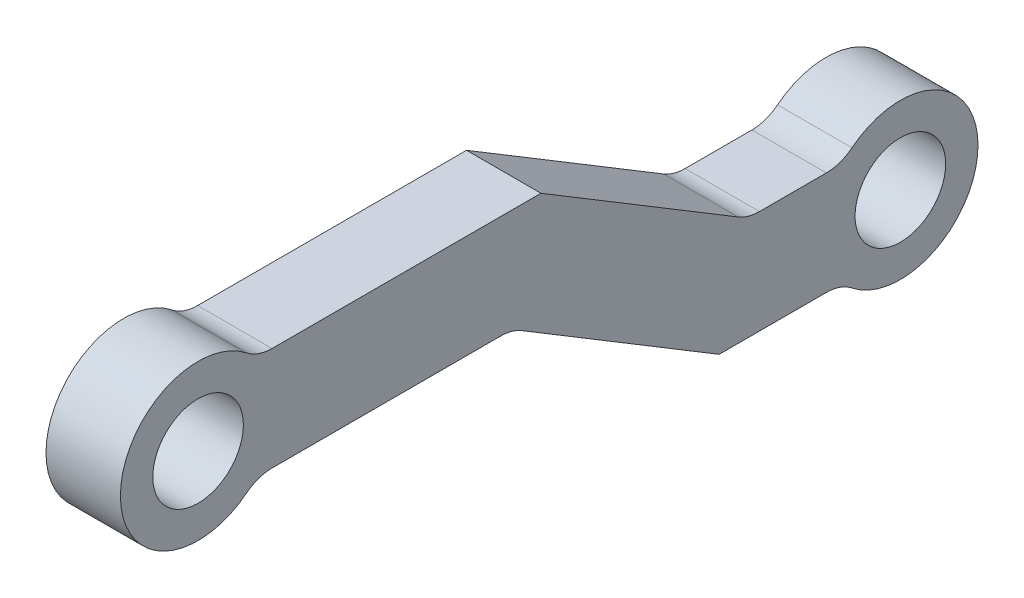
ISO-10303-21;
HEADER;
FILE_DESCRIPTION(('STEP AP214'),'2;1');
FILE_NAME('part.step','',(''),(''),'','','');
FILE_SCHEMA(('AUTOMOTIVE_DESIGN { 1 0 10303 214 1 1 1 1 }'));
ENDSEC;
DATA;
#1=APPLICATION_CONTEXT('core data for automotive mechanical design processes');
#2=APPLICATION_PROTOCOL_DEFINITION('international standard','automotive_design',2000,#1);
#3=PRODUCT_CONTEXT('',#1,'mechanical');
#4=PRODUCT('Part','Part','',(#3));
#5=PRODUCT_RELATED_PRODUCT_CATEGORY('part','',(#4));
#6=PRODUCT_DEFINITION_FORMATION('','',#4);
#7=PRODUCT_DEFINITION_CONTEXT('part definition',#1,'design');
#8=PRODUCT_DEFINITION('design','',#6,#7);
#9=PRODUCT_DEFINITION_SHAPE('','',#8);
#10=(LENGTH_UNIT() NAMED_UNIT(*) SI_UNIT(.MILLI.,.METRE.));
#11=(NAMED_UNIT(*) PLANE_ANGLE_UNIT() SI_UNIT($,.RADIAN.));
#12=(NAMED_UNIT(*) SI_UNIT($,.STERADIAN.) SOLID_ANGLE_UNIT());
#13=UNCERTAINTY_MEASURE_WITH_UNIT(LENGTH_MEASURE(1.E-05),#10,'distance_accuracy_value','');
#14=(GEOMETRIC_REPRESENTATION_CONTEXT(3) GLOBAL_UNCERTAINTY_ASSIGNED_CONTEXT((#13)) GLOBAL_UNIT_ASSIGNED_CONTEXT((#10,
#11,#12)) REPRESENTATION_CONTEXT('',''));
#15=CARTESIAN_POINT('',(0.,0.,0.));
#16=DIRECTION('',(0.,0.,1.));
#17=DIRECTION('',(1.,0.,0.));
#18=AXIS2_PLACEMENT_3D('',#15,#16,#17);
#19=CARTESIAN_POINT('',(2.875,-2.83310697109517,0.));
#20=DIRECTION('',(0.,1.,0.));
#21=DIRECTION('',(0.,0.,1.));
#22=AXIS2_PLACEMENT_3D('',#19,#20,#21);
#23=PLANE('',#22);
#24=DIRECTION('',(0.,0.,-1.));
#25=VECTOR('',#24,1.);
#26=CARTESIAN_POINT('',(0.,-2.83310697109517,0.));
#27=LINE('',#26,#25);
#28=CARTESIAN_POINT('',(0.,-2.83310697109517,-21.689696054792));
#29=VERTEX_POINT('',#28);
#30=CARTESIAN_POINT('',(0.,-2.83310697109517,-24.2737119489963));
#31=VERTEX_POINT('',#30);
#32=EDGE_CURVE('E257',#29,#31,#27,.T.);
#33=ORIENTED_EDGE('',*,*,#32,.F.);
#34=DIRECTION('',(-1.,0.,0.));
#35=VECTOR('',#34,1.);
#36=CARTESIAN_POINT('',(2.875,-2.83310697109517,-21.689696054792));
#37=LINE('',#36,#35);
#38=CARTESIAN_POINT('',(2.875,-2.83310697109517,-21.689696054792));
#39=VERTEX_POINT('',#38);
#40=EDGE_CURVE('E327',#29,#39,#37,.F.);
#41=ORIENTED_EDGE('',*,*,#40,.T.);
#42=DIRECTION('',(0.,0.,-1.));
#43=VECTOR('',#42,1.);
#44=CARTESIAN_POINT('',(2.875,-2.83310697109517,0.));
#45=LINE('',#44,#43);
#46=CARTESIAN_POINT('',(2.875,-2.83310697109517,-24.2737119489963));
#47=VERTEX_POINT('',#46);
#48=EDGE_CURVE('E241',#39,#47,#45,.T.);
#49=ORIENTED_EDGE('',*,*,#48,.T.);
#50=DIRECTION('',(-1.,0.,0.));
#51=VECTOR('',#50,1.);
#52=CARTESIAN_POINT('',(2.875,-2.83310697109517,-24.2737119489963));
#53=LINE('',#52,#51);
#54=EDGE_CURVE('E323',#47,#31,#53,.T.);
#55=ORIENTED_EDGE('',*,*,#54,.T.);
#56=EDGE_LOOP('',(#33,#41,#49,#55));
#57=FACE_BOUND('',#56,.T.);
#58=ADVANCED_FACE('F113',(#57),#23,.T.);
#59=CARTESIAN_POINT('',(2.875,7.32848216707025,-4.42741728115174));
#60=DIRECTION('',(0.,0.855926261123693,-0.517097897422544));
#61=DIRECTION('',(0.,0.517097897422544,0.855926261123693));
#62=AXIS2_PLACEMENT_3D('',#59,#60,#61);
#63=PLANE('',#62);
#64=DIRECTION('',(0.,-0.517097897422544,-0.855926261123693));
#65=VECTOR('',#64,1.);
#66=CARTESIAN_POINT('',(2.875,7.32848216707025,-4.42741728115174));
#67=LINE('',#66,#65);
#68=CARTESIAN_POINT('',(2.875,2.,-13.2473870421154));
#69=VERTEX_POINT('',#68);
#70=CARTESIAN_POINT('',(2.875,-2.60438991062904,-20.8688031426337));
#71=VERTEX_POINT('',#70);
#72=EDGE_CURVE('E221',#69,#71,#67,.T.);
#73=ORIENTED_EDGE('',*,*,#72,.T.);
#74=DIRECTION('',(-1.,0.,0.));
#75=VECTOR('',#74,1.);
#76=CARTESIAN_POINT('',(0.,-2.60438991062904,-20.8688031426337));
#77=LINE('',#76,#75);
#78=CARTESIAN_POINT('',(0.,-2.60438991062904,-20.8688031426337));
#79=VERTEX_POINT('',#78);
#80=EDGE_CURVE('E320',#71,#79,#77,.T.);
#81=ORIENTED_EDGE('',*,*,#80,.T.);
#82=DIRECTION('',(0.,-0.517097897422544,-0.855926261123693));
#83=VECTOR('',#82,1.);
#84=CARTESIAN_POINT('',(0.,7.32848216707025,-4.42741728115174));
#85=LINE('',#84,#83);
#86=CARTESIAN_POINT('',(0.,2.,-13.2473870421154));
#87=VERTEX_POINT('',#86);
#88=EDGE_CURVE('E229',#87,#79,#85,.T.);
#89=ORIENTED_EDGE('',*,*,#88,.F.);
#90=DIRECTION('',(-1.,0.,0.));
#91=VECTOR('',#90,1.);
#92=CARTESIAN_POINT('',(2.875,2.,-13.2473870421154));
#93=LINE('',#92,#91);
#94=EDGE_CURVE('E214',#69,#87,#93,.T.);
#95=ORIENTED_EDGE('',*,*,#94,.F.);
#96=EDGE_LOOP('',(#73,#81,#89,#95));
#97=FACE_BOUND('',#96,.T.);
#98=ADVANCED_FACE('F225',(#97),#63,.T.);
#99=CARTESIAN_POINT('',(2.875,2.,0.));
#100=DIRECTION('',(0.,1.,0.));
#101=DIRECTION('',(0.,0.,1.));
#102=AXIS2_PLACEMENT_3D('',#99,#100,#101);
#103=PLANE('',#102);
#104=DIRECTION('',(0.,0.,-1.));
#105=VECTOR('',#104,1.);
#106=CARTESIAN_POINT('',(0.,2.,0.));
#107=LINE('',#106,#105);
#108=CARTESIAN_POINT('',(0.,2.,-2.85919569109916));
#109=VERTEX_POINT('',#108);
#110=EDGE_CURVE('E264',#109,#87,#107,.T.);
#111=ORIENTED_EDGE('',*,*,#110,.F.);
#112=DIRECTION('',(-1.,0.,0.));
#113=VECTOR('',#112,1.);
#114=CARTESIAN_POINT('',(2.875,2.,-2.85919569109916));
#115=LINE('',#114,#113);
#116=CARTESIAN_POINT('',(2.875,2.,-2.85919569109916));
#117=VERTEX_POINT('',#116);
#118=EDGE_CURVE('E129',#109,#117,#115,.F.);
#119=ORIENTED_EDGE('',*,*,#118,.T.);
#120=DIRECTION('',(0.,0.,-1.));
#121=VECTOR('',#120,1.);
#122=CARTESIAN_POINT('',(2.875,2.,0.));
#123=LINE('',#122,#121);
#124=EDGE_CURVE('E211',#117,#69,#123,.T.);
#125=ORIENTED_EDGE('',*,*,#124,.T.);
#126=ORIENTED_EDGE('',*,*,#94,.T.);
#127=EDGE_LOOP('',(#111,#119,#125,#126));
#128=FACE_BOUND('',#127,.T.);
#129=ADVANCED_FACE('F213',(#128),#103,.T.);
#130=CARTESIAN_POINT('',(2.875,-2.,0.));
#131=DIRECTION('',(0.,1.,0.));
#132=DIRECTION('',(0.,0.,1.));
#133=AXIS2_PLACEMENT_3D('',#130,#131,#132);
#134=PLANE('',#133);
#135=DIRECTION('',(0.,0.,-1.));
#136=VECTOR('',#135,1.);
#137=CARTESIAN_POINT('',(0.,-2.,0.));
#138=LINE('',#137,#136);
#139=CARTESIAN_POINT('',(0.,-2.,-2.85919569109916));
#140=VERTEX_POINT('',#139);
#141=CARTESIAN_POINT('',(0.,-2.,-11.6905986274188));
#142=VERTEX_POINT('',#141);
#143=EDGE_CURVE('E267',#140,#142,#138,.T.);
#144=ORIENTED_EDGE('',*,*,#143,.T.);
#145=DIRECTION('',(-1.,0.,0.));
#146=VECTOR('',#145,1.);
#147=CARTESIAN_POINT('',(2.875,-2.,-11.6905986274188));
#148=LINE('',#147,#146);
#149=CARTESIAN_POINT('',(2.875,-2.,-11.6905986274188));
#150=VERTEX_POINT('',#149);
#151=EDGE_CURVE('E338',#142,#150,#148,.F.);
#152=ORIENTED_EDGE('',*,*,#151,.T.);
#153=DIRECTION('',(0.,0.,-1.));
#154=VECTOR('',#153,1.);
#155=CARTESIAN_POINT('',(2.875,-2.,0.));
#156=LINE('',#155,#154);
#157=CARTESIAN_POINT('',(2.875,-2.,-2.85919569109916));
#158=VERTEX_POINT('',#157);
#159=EDGE_CURVE('E220',#158,#150,#156,.T.);
#160=ORIENTED_EDGE('',*,*,#159,.F.);
#161=DIRECTION('',(1.,0.,0.));
#162=VECTOR('',#161,1.);
#163=CARTESIAN_POINT('',(0.,-2.,-2.85919569109916));
#164=LINE('',#163,#162);
#165=EDGE_CURVE('E334',#158,#140,#164,.F.);
#166=ORIENTED_EDGE('',*,*,#165,.T.);
#167=EDGE_LOOP('',(#144,#152,#160,#166));
#168=FACE_BOUND('',#167,.T.);
#169=ADVANCED_FACE('F412',(#168),#134,.F.);
#170=CARTESIAN_POINT('',(2.875,3.90477712257548,-2.35902569146156));
#171=DIRECTION('',(0.,0.855926261123693,-0.517097897422544));
#172=DIRECTION('',(0.,0.517097897422544,0.855926261123693));
#173=AXIS2_PLACEMENT_3D('',#170,#171,#172);
#174=PLANE('',#173);
#175=DIRECTION('',(0.,-0.517097897422544,-0.855926261123693));
#176=VECTOR('',#175,1.);
#177=CARTESIAN_POINT('',(2.875,3.90477712257548,-2.35902569146156));
#178=LINE('',#177,#176);
#179=CARTESIAN_POINT('',(2.875,-2.22871706046614,-12.5114915395771));
#180=VERTEX_POINT('',#179);
#181=CARTESIAN_POINT('',(2.875,-6.83310697109518,-20.1329076400955));
#182=VERTEX_POINT('',#181);
#183=EDGE_CURVE('E251',#180,#182,#178,.T.);
#184=ORIENTED_EDGE('',*,*,#183,.F.);
#185=DIRECTION('',(-1.,0.,0.));
#186=VECTOR('',#185,1.);
#187=CARTESIAN_POINT('',(0.,-2.22871706046614,-12.5114915395771));
#188=LINE('',#187,#186);
#189=CARTESIAN_POINT('',(0.,-2.22871706046614,-12.5114915395771));
#190=VERTEX_POINT('',#189);
#191=EDGE_CURVE('E330',#180,#190,#188,.T.);
#192=ORIENTED_EDGE('',*,*,#191,.T.);
#193=DIRECTION('',(0.,-0.517097897422544,-0.855926261123693));
#194=VECTOR('',#193,1.);
#195=CARTESIAN_POINT('',(0.,3.90477712257548,-2.35902569146156));
#196=LINE('',#195,#194);
#197=CARTESIAN_POINT('',(0.,-6.83310697109518,-20.1329076400955));
#198=VERTEX_POINT('',#197);
#199=EDGE_CURVE('E271',#190,#198,#196,.T.);
#200=ORIENTED_EDGE('',*,*,#199,.T.);
#201=DIRECTION('',(-1.,0.,0.));
#202=VECTOR('',#201,1.);
#203=CARTESIAN_POINT('',(2.875,-6.83310697109518,-20.1329076400955));
#204=LINE('',#203,#202);
#205=EDGE_CURVE('E232',#182,#198,#204,.T.);
#206=ORIENTED_EDGE('',*,*,#205,.F.);
#207=EDGE_LOOP('',(#184,#192,#200,#206));
#208=FACE_BOUND('',#207,.T.);
#209=ADVANCED_FACE('F406',(#208),#174,.F.);
#210=CARTESIAN_POINT('',(2.875,-6.83310697109517,0.));
#211=DIRECTION('',(0.,1.,0.));
#212=DIRECTION('',(0.,0.,1.));
#213=AXIS2_PLACEMENT_3D('',#210,#211,#212);
#214=PLANE('',#213);
#215=DIRECTION('',(0.,0.,-1.));
#216=VECTOR('',#215,1.);
#217=CARTESIAN_POINT('',(0.,-6.83310697109517,0.));
#218=LINE('',#217,#216);
#219=CARTESIAN_POINT('',(0.,-6.83310697109517,-24.2737119489963));
#220=VERTEX_POINT('',#219);
#221=EDGE_CURVE('E245',#198,#220,#218,.T.);
#222=ORIENTED_EDGE('',*,*,#221,.T.);
#223=DIRECTION('',(1.,0.,0.));
#224=VECTOR('',#223,1.);
#225=CARTESIAN_POINT('',(2.875,-6.83310697109517,-24.2737119489963));
#226=LINE('',#225,#224);
#227=CARTESIAN_POINT('',(2.875,-6.83310697109517,-24.2737119489963));
#228=VERTEX_POINT('',#227);
#229=EDGE_CURVE('E317',#220,#228,#226,.T.);
#230=ORIENTED_EDGE('',*,*,#229,.T.);
#231=DIRECTION('',(0.,0.,-1.));
#232=VECTOR('',#231,1.);
#233=CARTESIAN_POINT('',(2.875,-6.83310697109517,0.));
#234=LINE('',#233,#232);
#235=EDGE_CURVE('E254',#182,#228,#234,.T.);
#236=ORIENTED_EDGE('',*,*,#235,.F.);
#237=ORIENTED_EDGE('',*,*,#205,.T.);
#238=EDGE_LOOP('',(#222,#230,#236,#237));
#239=FACE_BOUND('',#238,.T.);
#240=ADVANCED_FACE('F401',(#239),#214,.F.);
#241=CARTESIAN_POINT('',(0.,0.,0.));
#242=DIRECTION('',(1.,0.,0.));
#243=DIRECTION('',(0.,0.,-1.));
#244=AXIS2_PLACEMENT_3D('',#241,#242,#243);
#245=PLANE('',#244);
#246=ORIENTED_EDGE('',*,*,#88,.T.);
#247=CARTESIAN_POINT('',(0.,-1.24560697109517,-21.689696054792));
#248=DIRECTION('',(1.,0.,0.));
#249=DIRECTION('',(0.,0.,-1.));
#250=AXIS2_PLACEMENT_3D('',#247,#248,#249);
#251=CIRCLE('',#250,1.5875);
#252=EDGE_CURVE('E356',#79,#29,#251,.T.);
#253=ORIENTED_EDGE('',*,*,#252,.T.);
#254=ORIENTED_EDGE('',*,*,#32,.T.);
#255=CARTESIAN_POINT('',(0.,-1.24560697109517,-24.2737119489963));
#256=DIRECTION('',(1.,0.,0.));
#257=DIRECTION('',(0.,0.,-1.));
#258=AXIS2_PLACEMENT_3D('',#255,#256,#257);
#259=CIRCLE('',#258,1.5875);
#260=CARTESIAN_POINT('',(0.,-2.48705792477365,-25.2631338911478));
#261=VERTEX_POINT('',#260);
#262=EDGE_CURVE('E373',#31,#261,#259,.T.);
#263=ORIENTED_EDGE('',*,*,#262,.T.);
#264=CARTESIAN_POINT('',(0.,-4.83310697109517,-27.1329076400955));
#265=DIRECTION('',(1.,0.,0.));
#266=DIRECTION('',(0.,0.,-1.));
#267=AXIS2_PLACEMENT_3D('',#264,#265,#266);
#268=CIRCLE('',#267,2.99999999999999);
#269=CARTESIAN_POINT('',(0.,-7.1791560174167,-25.2631338911478));
#270=VERTEX_POINT('',#269);
#271=EDGE_CURVE('E300',#270,#261,#268,.T.);
#272=ORIENTED_EDGE('',*,*,#271,.F.);
#273=CARTESIAN_POINT('',(0.,-8.42060697109518,-24.2737119489963));
#274=DIRECTION('',(1.,0.,0.));
#275=DIRECTION('',(0.,0.,-1.));
#276=AXIS2_PLACEMENT_3D('',#273,#274,#275);
#277=CIRCLE('',#276,1.5875);
#278=EDGE_CURVE('E350',#270,#220,#277,.T.);
#279=ORIENTED_EDGE('',*,*,#278,.T.);
#280=ORIENTED_EDGE('',*,*,#221,.F.);
#281=ORIENTED_EDGE('',*,*,#199,.F.);
#282=CARTESIAN_POINT('',(0.,-3.5875,-11.6905986274188));
#283=DIRECTION('',(1.,0.,0.));
#284=DIRECTION('',(0.,0.,-1.));
#285=AXIS2_PLACEMENT_3D('',#282,#283,#284);
#286=CIRCLE('',#285,1.5875);
#287=EDGE_CURVE('E361',#190,#142,#286,.T.);
#288=ORIENTED_EDGE('',*,*,#287,.T.);
#289=ORIENTED_EDGE('',*,*,#143,.F.);
#290=CARTESIAN_POINT('',(0.,-3.5875,-2.85919569109916));
#291=DIRECTION('',(1.,0.,0.));
#292=DIRECTION('',(0.,0.,-1.));
#293=AXIS2_PLACEMENT_3D('',#290,#291,#292);
#294=CIRCLE('',#293,1.5875);
#295=CARTESIAN_POINT('',(0.,-2.34604904632153,-1.86977374894768));
#296=VERTEX_POINT('',#295);
#297=EDGE_CURVE('E367',#140,#296,#294,.T.);
#298=ORIENTED_EDGE('',*,*,#297,.T.);
#299=CARTESIAN_POINT('',(0.,0.,0.));
#300=DIRECTION('',(1.,0.,0.));
#301=DIRECTION('',(0.,0.,-1.));
#302=AXIS2_PLACEMENT_3D('',#299,#300,#301);
#303=CIRCLE('',#302,3.);
#304=CARTESIAN_POINT('',(0.,2.34604904632153,-1.86977374894768));
#305=VERTEX_POINT('',#304);
#306=EDGE_CURVE('E284',#305,#296,#303,.T.);
#307=ORIENTED_EDGE('',*,*,#306,.F.);
#308=CARTESIAN_POINT('',(0.,3.5875,-2.85919569109916));
#309=DIRECTION('',(1.,0.,0.));
#310=DIRECTION('',(0.,0.,-1.));
#311=AXIS2_PLACEMENT_3D('',#308,#309,#310);
#312=CIRCLE('',#311,1.5875);
#313=EDGE_CURVE('E122',#305,#109,#312,.T.);
#314=ORIENTED_EDGE('',*,*,#313,.T.);
#315=ORIENTED_EDGE('',*,*,#110,.T.);
#316=EDGE_LOOP('',(#246,#253,#254,#263,#272,#279,#280,#281,#288,#289,#298,#307,#314,#315));
#317=FACE_BOUND('',#316,.T.);
#318=CARTESIAN_POINT('',(0.,0.,0.));
#319=DIRECTION('',(1.,0.,0.));
#320=DIRECTION('',(0.,0.,-1.));
#321=AXIS2_PLACEMENT_3D('',#318,#319,#320);
#322=CIRCLE('',#321,1.75);
#323=CARTESIAN_POINT('',(0.,0.,-1.75));
#324=VERTEX_POINT('',#323);
#325=EDGE_CURVE('E285',#324,#324,#322,.T.);
#326=ORIENTED_EDGE('',*,*,#325,.T.);
#327=EDGE_LOOP('',(#326));
#328=FACE_BOUND('',#327,.T.);
#329=CARTESIAN_POINT('',(0.,-4.83310697109517,-27.1329076400955));
#330=DIRECTION('',(1.,0.,0.));
#331=DIRECTION('',(0.,0.,-1.));
#332=AXIS2_PLACEMENT_3D('',#329,#330,#331);
#333=CIRCLE('',#332,1.75);
#334=CARTESIAN_POINT('',(0.,-4.83310697109517,-28.8829076400955));
#335=VERTEX_POINT('',#334);
#336=EDGE_CURVE('E301',#335,#335,#333,.T.);
#337=ORIENTED_EDGE('',*,*,#336,.T.);
#338=EDGE_LOOP('',(#337));
#339=FACE_BOUND('',#338,.T.);
#340=ADVANCED_FACE('F389',(#317,#328,#339),#245,.F.);
#341=CARTESIAN_POINT('',(2.875,0.,0.));
#342=DIRECTION('',(1.,0.,0.));
#343=DIRECTION('',(0.,0.,-1.));
#344=AXIS2_PLACEMENT_3D('',#341,#342,#343);
#345=PLANE('',#344);
#346=ORIENTED_EDGE('',*,*,#235,.T.);
#347=CARTESIAN_POINT('',(2.875,-8.42060697109518,-24.2737119489963));
#348=DIRECTION('',(1.,0.,0.));
#349=DIRECTION('',(0.,0.,-1.));
#350=AXIS2_PLACEMENT_3D('',#347,#348,#349);
#351=CIRCLE('',#350,1.5875);
#352=CARTESIAN_POINT('',(2.875,-7.1791560174167,-25.2631338911478));
#353=VERTEX_POINT('',#352);
#354=EDGE_CURVE('E353',#228,#353,#351,.F.);
#355=ORIENTED_EDGE('',*,*,#354,.T.);
#356=CARTESIAN_POINT('',(2.875,-4.83310697109517,-27.1329076400955));
#357=DIRECTION('',(1.,0.,0.));
#358=DIRECTION('',(0.,0.,-1.));
#359=AXIS2_PLACEMENT_3D('',#356,#357,#358);
#360=CIRCLE('',#359,2.99999999999999);
#361=CARTESIAN_POINT('',(2.875,-2.48705792477365,-25.2631338911478));
#362=VERTEX_POINT('',#361);
#363=EDGE_CURVE('E289',#353,#362,#360,.T.);
#364=ORIENTED_EDGE('',*,*,#363,.T.);
#365=CARTESIAN_POINT('',(2.875,-1.24560697109517,-24.2737119489963));
#366=DIRECTION('',(1.,0.,0.));
#367=DIRECTION('',(0.,0.,-1.));
#368=AXIS2_PLACEMENT_3D('',#365,#366,#367);
#369=CIRCLE('',#368,1.5875);
#370=EDGE_CURVE('E376',#362,#47,#369,.F.);
#371=ORIENTED_EDGE('',*,*,#370,.T.);
#372=ORIENTED_EDGE('',*,*,#48,.F.);
#373=CARTESIAN_POINT('',(2.875,-1.24560697109517,-21.689696054792));
#374=DIRECTION('',(1.,0.,0.));
#375=DIRECTION('',(0.,0.,-1.));
#376=AXIS2_PLACEMENT_3D('',#373,#374,#375);
#377=CIRCLE('',#376,1.5875);
#378=EDGE_CURVE('E239',#39,#71,#377,.F.);
#379=ORIENTED_EDGE('',*,*,#378,.T.);
#380=ORIENTED_EDGE('',*,*,#72,.F.);
#381=ORIENTED_EDGE('',*,*,#124,.F.);
#382=CARTESIAN_POINT('',(2.875,3.5875,-2.85919569109916));
#383=DIRECTION('',(1.,0.,0.));
#384=DIRECTION('',(0.,0.,-1.));
#385=AXIS2_PLACEMENT_3D('',#382,#383,#384);
#386=CIRCLE('',#385,1.5875);
#387=CARTESIAN_POINT('',(2.875,2.34604904632153,-1.86977374894768));
#388=VERTEX_POINT('',#387);
#389=EDGE_CURVE('E12',#117,#388,#386,.F.);
#390=ORIENTED_EDGE('',*,*,#389,.T.);
#391=CARTESIAN_POINT('',(2.875,0.,0.));
#392=DIRECTION('',(1.,0.,0.));
#393=DIRECTION('',(0.,0.,-1.));
#394=AXIS2_PLACEMENT_3D('',#391,#392,#393);
#395=CIRCLE('',#394,3.);
#396=CARTESIAN_POINT('',(2.875,-2.34604904632153,-1.86977374894768));
#397=VERTEX_POINT('',#396);
#398=EDGE_CURVE('E261',#388,#397,#395,.T.);
#399=ORIENTED_EDGE('',*,*,#398,.T.);
#400=CARTESIAN_POINT('',(2.875,-3.5875,-2.85919569109916));
#401=DIRECTION('',(1.,0.,0.));
#402=DIRECTION('',(0.,0.,-1.));
#403=AXIS2_PLACEMENT_3D('',#400,#401,#402);
#404=CIRCLE('',#403,1.5875);
#405=EDGE_CURVE('E370',#397,#158,#404,.F.);
#406=ORIENTED_EDGE('',*,*,#405,.T.);
#407=ORIENTED_EDGE('',*,*,#159,.T.);
#408=CARTESIAN_POINT('',(2.875,-3.5875,-11.6905986274188));
#409=DIRECTION('',(1.,0.,0.));
#410=DIRECTION('',(0.,0.,-1.));
#411=AXIS2_PLACEMENT_3D('',#408,#409,#410);
#412=CIRCLE('',#411,1.5875);
#413=EDGE_CURVE('E364',#150,#180,#412,.F.);
#414=ORIENTED_EDGE('',*,*,#413,.T.);
#415=ORIENTED_EDGE('',*,*,#183,.T.);
#416=EDGE_LOOP('',(#346,#355,#364,#371,#372,#379,#380,#381,#390,#399,#406,#407,#414,#415));
#417=FACE_BOUND('',#416,.T.);
#418=CARTESIAN_POINT('',(2.875,0.,0.));
#419=DIRECTION('',(1.,0.,0.));
#420=DIRECTION('',(0.,0.,-1.));
#421=AXIS2_PLACEMENT_3D('',#418,#419,#420);
#422=CIRCLE('',#421,1.75);
#423=CARTESIAN_POINT('',(2.875,0.,-1.75));
#424=VERTEX_POINT('',#423);
#425=EDGE_CURVE('E280',#424,#424,#422,.T.);
#426=ORIENTED_EDGE('',*,*,#425,.F.);
#427=EDGE_LOOP('',(#426));
#428=FACE_BOUND('',#427,.T.);
#429=CARTESIAN_POINT('',(2.875,-4.83310697109517,-27.1329076400955));
#430=DIRECTION('',(1.,0.,0.));
#431=DIRECTION('',(0.,0.,-1.));
#432=AXIS2_PLACEMENT_3D('',#429,#430,#431);
#433=CIRCLE('',#432,1.75);
#434=CARTESIAN_POINT('',(2.875,-4.83310697109517,-28.8829076400955));
#435=VERTEX_POINT('',#434);
#436=EDGE_CURVE('E296',#435,#435,#433,.T.);
#437=ORIENTED_EDGE('',*,*,#436,.F.);
#438=EDGE_LOOP('',(#437));
#439=FACE_BOUND('',#438,.T.);
#440=ADVANCED_FACE('F235',(#417,#428,#439),#345,.T.);
#441=CARTESIAN_POINT('',(2.875,-4.83310697109517,-27.1329076400955));
#442=DIRECTION('',(-1.,0.,0.));
#443=DIRECTION('',(0.,0.,1.));
#444=AXIS2_PLACEMENT_3D('',#441,#442,#443);
#445=CYLINDRICAL_SURFACE('',#444,1.75);
#446=ORIENTED_EDGE('',*,*,#436,.T.);
#447=EDGE_LOOP('',(#446));
#448=FACE_BOUND('',#447,.T.);
#449=ORIENTED_EDGE('',*,*,#336,.F.);
#450=EDGE_LOOP('',(#449));
#451=FACE_BOUND('',#450,.T.);
#452=ADVANCED_FACE('F444',(#448,#451),#445,.F.);
#453=CARTESIAN_POINT('',(2.875,-4.83310697109517,-27.1329076400955));
#454=DIRECTION('',(-1.,0.,0.));
#455=DIRECTION('',(0.,0.,1.));
#456=AXIS2_PLACEMENT_3D('',#453,#454,#455);
#457=CYLINDRICAL_SURFACE('',#456,2.99999999999999);
#458=ORIENTED_EDGE('',*,*,#363,.F.);
#459=DIRECTION('',(-1.,0.,0.));
#460=VECTOR('',#459,1.);
#461=CARTESIAN_POINT('',(2.875,-7.1791560174167,-25.2631338911478));
#462=LINE('',#461,#460);
#463=EDGE_CURVE('E313',#353,#270,#462,.T.);
#464=ORIENTED_EDGE('',*,*,#463,.T.);
#465=ORIENTED_EDGE('',*,*,#271,.T.);
#466=DIRECTION('',(-1.,0.,0.));
#467=VECTOR('',#466,1.);
#468=CARTESIAN_POINT('',(2.875,-2.48705792477365,-25.2631338911478));
#469=LINE('',#468,#467);
#470=EDGE_CURVE('E231',#261,#362,#469,.F.);
#471=ORIENTED_EDGE('',*,*,#470,.T.);
#472=EDGE_LOOP('',(#458,#464,#465,#471));
#473=FACE_BOUND('',#472,.T.);
#474=ADVANCED_FACE('F392',(#473),#457,.T.);
#475=CARTESIAN_POINT('',(2.875,0.,0.));
#476=DIRECTION('',(-1.,0.,0.));
#477=DIRECTION('',(0.,0.,1.));
#478=AXIS2_PLACEMENT_3D('',#475,#476,#477);
#479=CYLINDRICAL_SURFACE('',#478,1.75);
#480=ORIENTED_EDGE('',*,*,#425,.T.);
#481=EDGE_LOOP('',(#480));
#482=FACE_BOUND('',#481,.T.);
#483=ORIENTED_EDGE('',*,*,#325,.F.);
#484=EDGE_LOOP('',(#483));
#485=FACE_BOUND('',#484,.T.);
#486=ADVANCED_FACE('F439',(#482,#485),#479,.F.);
#487=CARTESIAN_POINT('',(2.875,0.,0.));
#488=DIRECTION('',(-1.,0.,0.));
#489=DIRECTION('',(0.,0.,1.));
#490=AXIS2_PLACEMENT_3D('',#487,#488,#489);
#491=CYLINDRICAL_SURFACE('',#490,3.);
#492=ORIENTED_EDGE('',*,*,#306,.T.);
#493=DIRECTION('',(-1.,0.,0.));
#494=VECTOR('',#493,1.);
#495=CARTESIAN_POINT('',(2.875,-2.34604904632153,-1.86977374894768));
#496=LINE('',#495,#494);
#497=EDGE_CURVE('E345',#296,#397,#496,.F.);
#498=ORIENTED_EDGE('',*,*,#497,.T.);
#499=ORIENTED_EDGE('',*,*,#398,.F.);
#500=DIRECTION('',(-1.,0.,0.));
#501=VECTOR('',#500,1.);
#502=CARTESIAN_POINT('',(2.875,2.34604904632153,-1.86977374894768));
#503=LINE('',#502,#501);
#504=EDGE_CURVE('E341',#388,#305,#503,.T.);
#505=ORIENTED_EDGE('',*,*,#504,.T.);
#506=EDGE_LOOP('',(#492,#498,#499,#505));
#507=FACE_BOUND('',#506,.T.);
#508=ADVANCED_FACE('F422',(#507),#491,.T.);
#509=CARTESIAN_POINT('',(2.875,-8.42060697109518,-24.2737119489963));
#510=DIRECTION('',(-1.,0.,0.));
#511=DIRECTION('',(0.,0.,1.));
#512=AXIS2_PLACEMENT_3D('',#509,#510,#511);
#513=CYLINDRICAL_SURFACE('',#512,1.5875);
#514=ORIENTED_EDGE('',*,*,#354,.F.);
#515=ORIENTED_EDGE('',*,*,#229,.F.);
#516=ORIENTED_EDGE('',*,*,#278,.F.);
#517=ORIENTED_EDGE('',*,*,#463,.F.);
#518=EDGE_LOOP('',(#514,#515,#516,#517));
#519=FACE_BOUND('',#518,.T.);
#520=ADVANCED_FACE('F396',(#519),#513,.F.);
#521=CARTESIAN_POINT('',(2.875,-1.24560697109517,-21.689696054792));
#522=DIRECTION('',(1.,0.,0.));
#523=DIRECTION('',(0.,0.,-1.));
#524=AXIS2_PLACEMENT_3D('',#521,#522,#523);
#525=CYLINDRICAL_SURFACE('',#524,1.5875);
#526=ORIENTED_EDGE('',*,*,#378,.F.);
#527=ORIENTED_EDGE('',*,*,#40,.F.);
#528=ORIENTED_EDGE('',*,*,#252,.F.);
#529=ORIENTED_EDGE('',*,*,#80,.F.);
#530=EDGE_LOOP('',(#526,#527,#528,#529));
#531=FACE_BOUND('',#530,.T.);
#532=ADVANCED_FACE('F452',(#531),#525,.F.);
#533=CARTESIAN_POINT('',(2.875,-3.5875,-11.6905986274188));
#534=DIRECTION('',(1.,0.,0.));
#535=DIRECTION('',(0.,0.,-1.));
#536=AXIS2_PLACEMENT_3D('',#533,#534,#535);
#537=CYLINDRICAL_SURFACE('',#536,1.5875);
#538=ORIENTED_EDGE('',*,*,#413,.F.);
#539=ORIENTED_EDGE('',*,*,#151,.F.);
#540=ORIENTED_EDGE('',*,*,#287,.F.);
#541=ORIENTED_EDGE('',*,*,#191,.F.);
#542=EDGE_LOOP('',(#538,#539,#540,#541));
#543=FACE_BOUND('',#542,.T.);
#544=ADVANCED_FACE('F416',(#543),#537,.F.);
#545=CARTESIAN_POINT('',(2.875,-3.5875,-2.85919569109916));
#546=DIRECTION('',(-1.,0.,0.));
#547=DIRECTION('',(0.,0.,1.));
#548=AXIS2_PLACEMENT_3D('',#545,#546,#547);
#549=CYLINDRICAL_SURFACE('',#548,1.5875);
#550=ORIENTED_EDGE('',*,*,#405,.F.);
#551=ORIENTED_EDGE('',*,*,#497,.F.);
#552=ORIENTED_EDGE('',*,*,#297,.F.);
#553=ORIENTED_EDGE('',*,*,#165,.F.);
#554=EDGE_LOOP('',(#550,#551,#552,#553));
#555=FACE_BOUND('',#554,.T.);
#556=ADVANCED_FACE('F419',(#555),#549,.F.);
#557=CARTESIAN_POINT('',(2.875,-1.24560697109517,-24.2737119489963));
#558=DIRECTION('',(-1.,0.,0.));
#559=DIRECTION('',(0.,0.,1.));
#560=AXIS2_PLACEMENT_3D('',#557,#558,#559);
#561=CYLINDRICAL_SURFACE('',#560,1.5875);
#562=ORIENTED_EDGE('',*,*,#370,.F.);
#563=ORIENTED_EDGE('',*,*,#470,.F.);
#564=ORIENTED_EDGE('',*,*,#262,.F.);
#565=ORIENTED_EDGE('',*,*,#54,.F.);
#566=EDGE_LOOP('',(#562,#563,#564,#565));
#567=FACE_BOUND('',#566,.T.);
#568=ADVANCED_FACE('F387',(#567),#561,.F.);
#569=CARTESIAN_POINT('',(2.875,3.5875,-2.85919569109916));
#570=DIRECTION('',(-1.,0.,0.));
#571=DIRECTION('',(0.,0.,1.));
#572=AXIS2_PLACEMENT_3D('',#569,#570,#571);
#573=CYLINDRICAL_SURFACE('',#572,1.5875);
#574=ORIENTED_EDGE('',*,*,#389,.F.);
#575=ORIENTED_EDGE('',*,*,#118,.F.);
#576=ORIENTED_EDGE('',*,*,#313,.F.);
#577=ORIENTED_EDGE('',*,*,#504,.F.);
#578=EDGE_LOOP('',(#574,#575,#576,#577));
#579=FACE_BOUND('',#578,.T.);
#580=ADVANCED_FACE('F115',(#579),#573,.F.);
#581=CLOSED_SHELL('',(#58,#98,#129,#169,#209,#240,#340,#440,#452,#474,#486,#508,#520,#532,#544,
#556,#568,#580));
#582=MANIFOLD_SOLID_BREP('B2',#581);
#583=ADVANCED_BREP_SHAPE_REPRESENTATION('',(#18,#582),#14);
#584=SHAPE_DEFINITION_REPRESENTATION(#9,#583);
ENDSEC;
END-ISO-10303-21;
